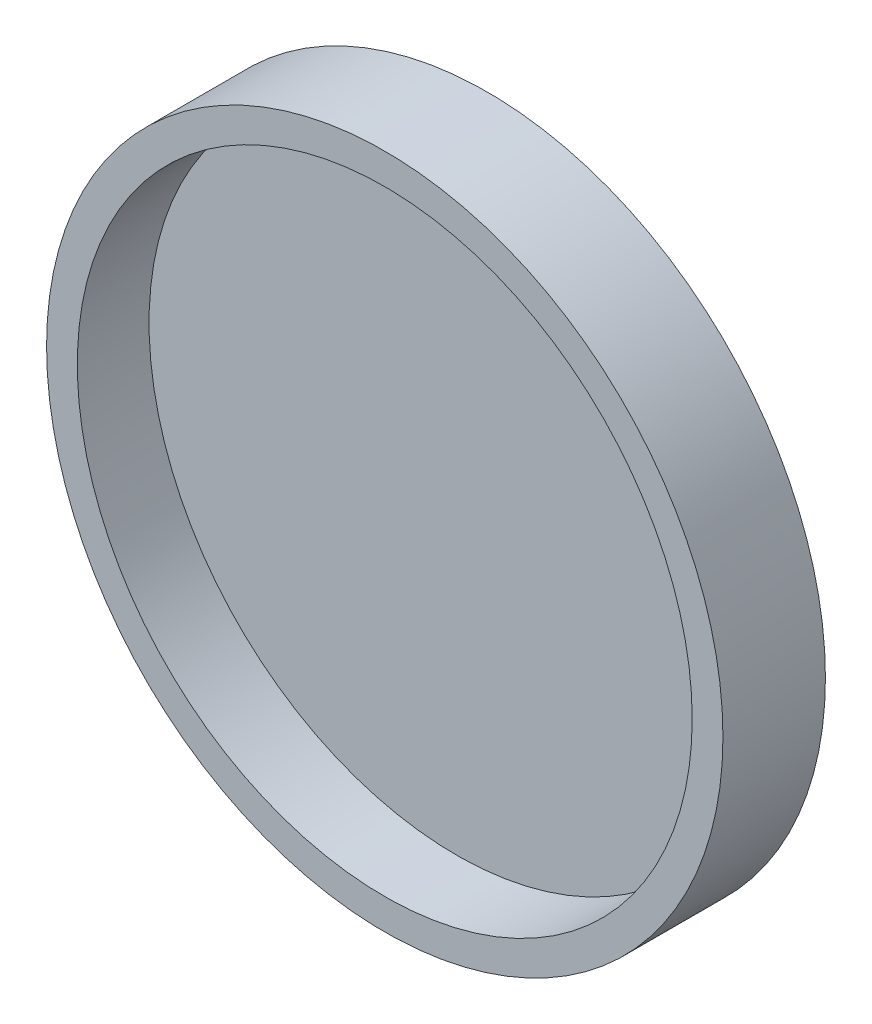
ISO-10303-21;
HEADER;
FILE_DESCRIPTION(('STEP AP214'),'2;1');
FILE_NAME('part.step','',(''),(''),'','','');
FILE_SCHEMA(('AUTOMOTIVE_DESIGN { 1 0 10303 214 1 1 1 1 }'));
ENDSEC;
DATA;
#1=APPLICATION_CONTEXT('core data for automotive mechanical design processes');
#2=APPLICATION_PROTOCOL_DEFINITION('international standard','automotive_design',2000,#1);
#3=PRODUCT_CONTEXT('',#1,'mechanical');
#4=PRODUCT('Part','Part','',(#3));
#5=PRODUCT_RELATED_PRODUCT_CATEGORY('part','',(#4));
#6=PRODUCT_DEFINITION_FORMATION('','',#4);
#7=PRODUCT_DEFINITION_CONTEXT('part definition',#1,'design');
#8=PRODUCT_DEFINITION('design','',#6,#7);
#9=PRODUCT_DEFINITION_SHAPE('','',#8);
#10=(LENGTH_UNIT() NAMED_UNIT(*) SI_UNIT(.MILLI.,.METRE.));
#11=(NAMED_UNIT(*) PLANE_ANGLE_UNIT() SI_UNIT($,.RADIAN.));
#12=(NAMED_UNIT(*) SI_UNIT($,.STERADIAN.) SOLID_ANGLE_UNIT());
#13=UNCERTAINTY_MEASURE_WITH_UNIT(LENGTH_MEASURE(1.E-05),#10,'distance_accuracy_value','');
#14=(GEOMETRIC_REPRESENTATION_CONTEXT(3) GLOBAL_UNCERTAINTY_ASSIGNED_CONTEXT((#13)) GLOBAL_UNIT_ASSIGNED_CONTEXT((#10,
#11,#12)) REPRESENTATION_CONTEXT('',''));
#15=CARTESIAN_POINT('',(0.,0.,0.));
#16=DIRECTION('',(0.,0.,1.));
#17=DIRECTION('',(1.,0.,0.));
#18=AXIS2_PLACEMENT_3D('',#15,#16,#17);
#19=CARTESIAN_POINT('',(-34.8407866914176,9.70589863289998,10.));
#20=DIRECTION('',(0.,0.,-1.));
#21=DIRECTION('',(-1.,0.,0.));
#22=AXIS2_PLACEMENT_3D('',#19,#20,#21);
#23=CYLINDRICAL_SURFACE('',#22,33.);
#24=CARTESIAN_POINT('',(-34.8407866914176,9.70589863289998,10.));
#25=DIRECTION('',(0.,0.,1.));
#26=DIRECTION('',(1.,0.,0.));
#27=AXIS2_PLACEMENT_3D('',#24,#25,#26);
#28=CIRCLE('',#27,33.);
#29=CARTESIAN_POINT('',(-1.8407866914176,9.70589863289998,10.));
#30=VERTEX_POINT('',#29);
#31=EDGE_CURVE('E10',#30,#30,#28,.T.);
#32=ORIENTED_EDGE('',*,*,#31,.F.);
#33=EDGE_LOOP('',(#32));
#34=FACE_BOUND('',#33,.T.);
#35=CARTESIAN_POINT('',(-34.8407866914176,9.70589863289998,0.));
#36=DIRECTION('',(0.,0.,1.));
#37=DIRECTION('',(1.,0.,0.));
#38=AXIS2_PLACEMENT_3D('',#35,#36,#37);
#39=CIRCLE('',#38,33.);
#40=CARTESIAN_POINT('',(-1.8407866914176,9.70589863289998,0.));
#41=VERTEX_POINT('',#40);
#42=EDGE_CURVE('E36',#41,#41,#39,.T.);
#43=ORIENTED_EDGE('',*,*,#42,.T.);
#44=EDGE_LOOP('',(#43));
#45=FACE_BOUND('',#44,.T.);
#46=ADVANCED_FACE('F33',(#34,#45),#23,.T.);
#47=CARTESIAN_POINT('',(-34.8407866914176,9.70589863289998,10.));
#48=DIRECTION('',(0.,0.,1.));
#49=DIRECTION('',(1.,0.,0.));
#50=AXIS2_PLACEMENT_3D('',#47,#48,#49);
#51=PLANE('',#50);
#52=CARTESIAN_POINT('',(-34.8407866914176,9.70589863289998,10.));
#53=DIRECTION('',(0.,0.,1.));
#54=DIRECTION('',(1.,0.,0.));
#55=AXIS2_PLACEMENT_3D('',#52,#53,#54);
#56=CIRCLE('',#55,30.);
#57=CARTESIAN_POINT('',(-4.8407866914176,9.70589863289998,10.));
#58=VERTEX_POINT('',#57);
#59=EDGE_CURVE('E43',#58,#58,#56,.T.);
#60=ORIENTED_EDGE('',*,*,#59,.F.);
#61=EDGE_LOOP('',(#60));
#62=FACE_BOUND('',#61,.T.);
#63=ORIENTED_EDGE('',*,*,#31,.T.);
#64=EDGE_LOOP('',(#63));
#65=FACE_BOUND('',#64,.T.);
#66=ADVANCED_FACE('F63',(#62,#65),#51,.T.);
#67=CARTESIAN_POINT('',(-34.8407866914176,9.70589863289998,0.));
#68=DIRECTION('',(0.,0.,1.));
#69=DIRECTION('',(1.,0.,0.));
#70=AXIS2_PLACEMENT_3D('',#67,#68,#69);
#71=PLANE('',#70);
#72=ORIENTED_EDGE('',*,*,#42,.F.);
#73=EDGE_LOOP('',(#72));
#74=FACE_BOUND('',#73,.T.);
#75=ADVANCED_FACE('F55',(#74),#71,.F.);
#76=CARTESIAN_POINT('',(-34.8407866914176,9.70589863289998,10.));
#77=DIRECTION('',(0.,0.,-1.));
#78=DIRECTION('',(-1.,0.,0.));
#79=AXIS2_PLACEMENT_3D('',#76,#77,#78);
#80=CYLINDRICAL_SURFACE('',#79,30.);
#81=ORIENTED_EDGE('',*,*,#59,.T.);
#82=EDGE_LOOP('',(#81));
#83=FACE_BOUND('',#82,.T.);
#84=CARTESIAN_POINT('',(-34.8407866914176,9.70589863289998,3.));
#85=DIRECTION('',(0.,0.,1.));
#86=DIRECTION('',(1.,0.,0.));
#87=AXIS2_PLACEMENT_3D('',#84,#85,#86);
#88=CIRCLE('',#87,30.);
#89=CARTESIAN_POINT('',(-4.8407866914176,9.70589863289998,3.));
#90=VERTEX_POINT('',#89);
#91=EDGE_CURVE('E47',#90,#90,#88,.T.);
#92=ORIENTED_EDGE('',*,*,#91,.F.);
#93=EDGE_LOOP('',(#92));
#94=FACE_BOUND('',#93,.T.);
#95=ADVANCED_FACE('F53',(#83,#94),#80,.F.);
#96=CARTESIAN_POINT('',(-34.8407866914176,9.70589863289998,3.));
#97=DIRECTION('',(0.,0.,1.));
#98=DIRECTION('',(1.,0.,0.));
#99=AXIS2_PLACEMENT_3D('',#96,#97,#98);
#100=PLANE('',#99);
#101=ORIENTED_EDGE('',*,*,#91,.T.);
#102=EDGE_LOOP('',(#101));
#103=FACE_BOUND('',#102,.T.);
#104=ADVANCED_FACE('F51',(#103),#100,.T.);
#105=CLOSED_SHELL('',(#46,#66,#75,#95,#104));
#106=MANIFOLD_SOLID_BREP('B2',#105);
#107=ADVANCED_BREP_SHAPE_REPRESENTATION('',(#18,#106),#14);
#108=SHAPE_DEFINITION_REPRESENTATION(#9,#107);
ENDSEC;
END-ISO-10303-21;
